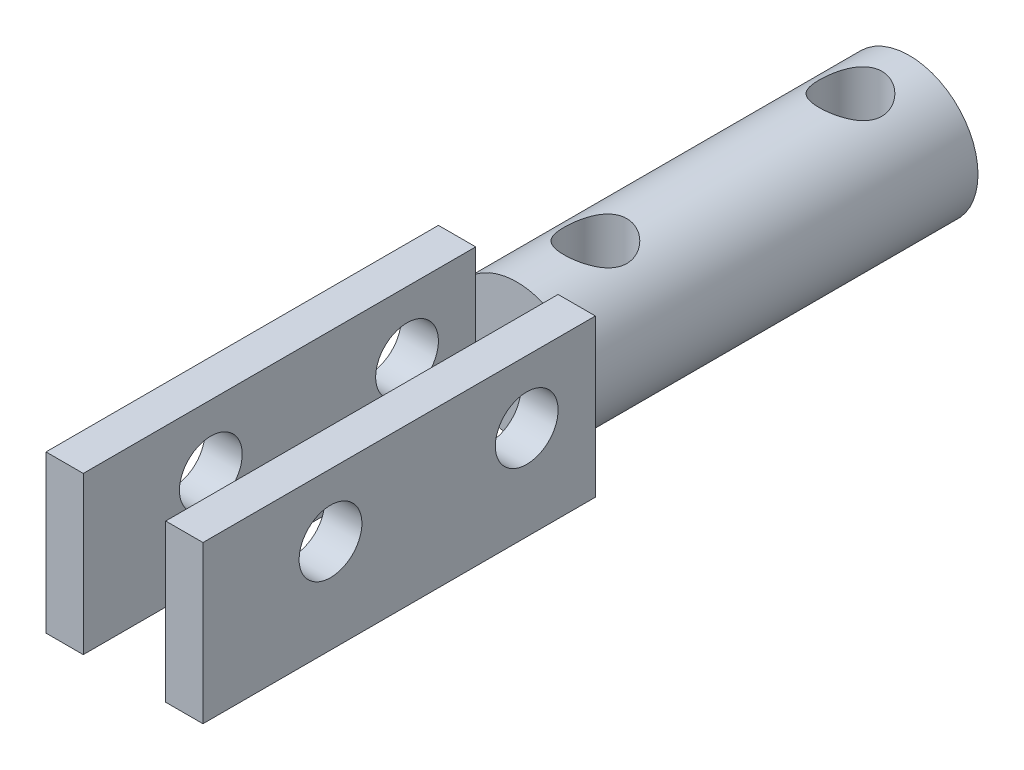
ISO-10303-21;
HEADER;
FILE_DESCRIPTION(('STEP AP214'),'2;1');
FILE_NAME('part.step','',(''),(''),'','','');
FILE_SCHEMA(('AUTOMOTIVE_DESIGN { 1 0 10303 214 1 1 1 1 }'));
ENDSEC;
DATA;
#1=APPLICATION_CONTEXT('core data for automotive mechanical design processes');
#2=APPLICATION_PROTOCOL_DEFINITION('international standard','automotive_design',2000,#1);
#3=PRODUCT_CONTEXT('',#1,'mechanical');
#4=PRODUCT('Part','Part','',(#3));
#5=PRODUCT_RELATED_PRODUCT_CATEGORY('part','',(#4));
#6=PRODUCT_DEFINITION_FORMATION('','',#4);
#7=PRODUCT_DEFINITION_CONTEXT('part definition',#1,'design');
#8=PRODUCT_DEFINITION('design','',#6,#7);
#9=PRODUCT_DEFINITION_SHAPE('','',#8);
#10=(LENGTH_UNIT() NAMED_UNIT(*) SI_UNIT(.MILLI.,.METRE.));
#11=(NAMED_UNIT(*) PLANE_ANGLE_UNIT() SI_UNIT($,.RADIAN.));
#12=(NAMED_UNIT(*) SI_UNIT($,.STERADIAN.) SOLID_ANGLE_UNIT());
#13=UNCERTAINTY_MEASURE_WITH_UNIT(LENGTH_MEASURE(1.E-05),#10,'distance_accuracy_value','');
#14=(GEOMETRIC_REPRESENTATION_CONTEXT(3) GLOBAL_UNCERTAINTY_ASSIGNED_CONTEXT((#13)) GLOBAL_UNIT_ASSIGNED_CONTEXT((#10,
#11,#12)) REPRESENTATION_CONTEXT('',''));
#15=CARTESIAN_POINT('',(0.,0.,0.));
#16=DIRECTION('',(0.,0.,1.));
#17=DIRECTION('',(1.,0.,0.));
#18=AXIS2_PLACEMENT_3D('',#15,#16,#17);
#19=CARTESIAN_POINT('',(-4.,-4.,40.));
#20=DIRECTION('',(0.,1.,0.));
#21=DIRECTION('',(0.,0.,1.));
#22=AXIS2_PLACEMENT_3D('',#19,#20,#21);
#23=PLANE('',#22);
#24=DIRECTION('',(1.,0.,0.));
#25=VECTOR('',#24,1.);
#26=CARTESIAN_POINT('',(-4.,-4.,40.));
#27=LINE('',#26,#25);
#28=CARTESIAN_POINT('',(2.1,-4.,40.));
#29=VERTEX_POINT('',#28);
#30=CARTESIAN_POINT('',(4.,-4.,40.));
#31=VERTEX_POINT('',#30);
#32=EDGE_CURVE('E155',#29,#31,#27,.T.);
#33=ORIENTED_EDGE('',*,*,#32,.F.);
#34=DIRECTION('',(0.,0.,1.));
#35=VECTOR('',#34,1.);
#36=CARTESIAN_POINT('',(2.1,-4.,20.));
#37=LINE('',#36,#35);
#38=CARTESIAN_POINT('',(2.1,-4.,20.));
#39=VERTEX_POINT('',#38);
#40=EDGE_CURVE('E236',#39,#29,#37,.T.);
#41=ORIENTED_EDGE('',*,*,#40,.F.);
#42=DIRECTION('',(1.,0.,0.));
#43=VECTOR('',#42,1.);
#44=CARTESIAN_POINT('',(-4.,-4.,20.));
#45=LINE('',#44,#43);
#46=CARTESIAN_POINT('',(4.,-4.,20.));
#47=VERTEX_POINT('',#46);
#48=EDGE_CURVE('E232',#39,#47,#45,.T.);
#49=ORIENTED_EDGE('',*,*,#48,.T.);
#50=DIRECTION('',(0.,0.,-1.));
#51=VECTOR('',#50,1.);
#52=CARTESIAN_POINT('',(4.,-4.,40.));
#53=LINE('',#52,#51);
#54=EDGE_CURVE('E165',#31,#47,#53,.T.);
#55=ORIENTED_EDGE('',*,*,#54,.F.);
#56=EDGE_LOOP('',(#33,#41,#49,#55));
#57=FACE_BOUND('',#56,.T.);
#58=ADVANCED_FACE('F35',(#57),#23,.F.);
#59=CARTESIAN_POINT('',(-4.,4.,40.));
#60=DIRECTION('',(0.,-1.,0.));
#61=DIRECTION('',(0.,0.,-1.));
#62=AXIS2_PLACEMENT_3D('',#59,#60,#61);
#63=PLANE('',#62);
#64=DIRECTION('',(-1.,0.,0.));
#65=VECTOR('',#64,1.);
#66=CARTESIAN_POINT('',(-4.,4.,20.));
#67=LINE('',#66,#65);
#68=CARTESIAN_POINT('',(4.,4.,20.));
#69=VERTEX_POINT('',#68);
#70=CARTESIAN_POINT('',(2.1,4.,20.));
#71=VERTEX_POINT('',#70);
#72=EDGE_CURVE('E144',#69,#71,#67,.T.);
#73=ORIENTED_EDGE('',*,*,#72,.T.);
#74=DIRECTION('',(0.,0.,1.));
#75=VECTOR('',#74,1.);
#76=CARTESIAN_POINT('',(2.1,4.,20.));
#77=LINE('',#76,#75);
#78=CARTESIAN_POINT('',(2.1,4.,40.));
#79=VERTEX_POINT('',#78);
#80=EDGE_CURVE('E125',#71,#79,#77,.T.);
#81=ORIENTED_EDGE('',*,*,#80,.T.);
#82=DIRECTION('',(-1.,0.,0.));
#83=VECTOR('',#82,1.);
#84=CARTESIAN_POINT('',(-4.,4.,40.));
#85=LINE('',#84,#83);
#86=CARTESIAN_POINT('',(4.,4.,40.));
#87=VERTEX_POINT('',#86);
#88=EDGE_CURVE('E163',#87,#79,#85,.T.);
#89=ORIENTED_EDGE('',*,*,#88,.F.);
#90=DIRECTION('',(0.,0.,-1.));
#91=VECTOR('',#90,1.);
#92=CARTESIAN_POINT('',(4.,4.,40.));
#93=LINE('',#92,#91);
#94=EDGE_CURVE('E152',#87,#69,#93,.T.);
#95=ORIENTED_EDGE('',*,*,#94,.T.);
#96=EDGE_LOOP('',(#73,#81,#89,#95));
#97=FACE_BOUND('',#96,.T.);
#98=ADVANCED_FACE('F150',(#97),#63,.F.);
#99=CARTESIAN_POINT('',(0.,0.,40.));
#100=DIRECTION('',(0.,0.,-1.));
#101=DIRECTION('',(-1.,0.,0.));
#102=AXIS2_PLACEMENT_3D('',#99,#100,#101);
#103=PLANE('',#102);
#104=ORIENTED_EDGE('',*,*,#88,.T.);
#105=DIRECTION('',(0.,1.,0.));
#106=VECTOR('',#105,1.);
#107=CARTESIAN_POINT('',(2.1,-4.,40.));
#108=LINE('',#107,#106);
#109=EDGE_CURVE('E131',#29,#79,#108,.T.);
#110=ORIENTED_EDGE('',*,*,#109,.F.);
#111=ORIENTED_EDGE('',*,*,#32,.T.);
#112=DIRECTION('',(0.,1.,0.));
#113=VECTOR('',#112,1.);
#114=CARTESIAN_POINT('',(4.,-4.,40.));
#115=LINE('',#114,#113);
#116=EDGE_CURVE('E238',#31,#87,#115,.T.);
#117=ORIENTED_EDGE('',*,*,#116,.T.);
#118=EDGE_LOOP('',(#104,#110,#111,#117));
#119=FACE_BOUND('',#118,.T.);
#120=ADVANCED_FACE('F210',(#119),#103,.F.);
#121=CARTESIAN_POINT('',(0.,0.,20.));
#122=DIRECTION('',(0.,0.,-1.));
#123=DIRECTION('',(-1.,0.,0.));
#124=AXIS2_PLACEMENT_3D('',#121,#122,#123);
#125=PLANE('',#124);
#126=DIRECTION('',(0.,-1.,0.));
#127=VECTOR('',#126,1.);
#128=CARTESIAN_POINT('',(2.1,0.,20.));
#129=LINE('',#128,#127);
#130=CARTESIAN_POINT('',(2.1,2.8,20.));
#131=VERTEX_POINT('',#130);
#132=EDGE_CURVE('E11',#71,#131,#129,.T.);
#133=ORIENTED_EDGE('',*,*,#132,.F.);
#134=ORIENTED_EDGE('',*,*,#72,.F.);
#135=DIRECTION('',(0.,1.,0.));
#136=VECTOR('',#135,1.);
#137=CARTESIAN_POINT('',(4.,-4.,20.));
#138=LINE('',#137,#136);
#139=EDGE_CURVE('E157',#47,#69,#138,.T.);
#140=ORIENTED_EDGE('',*,*,#139,.F.);
#141=ORIENTED_EDGE('',*,*,#48,.F.);
#142=DIRECTION('',(0.,1.,0.));
#143=VECTOR('',#142,1.);
#144=CARTESIAN_POINT('',(2.1,-4.,20.));
#145=LINE('',#144,#143);
#146=CARTESIAN_POINT('',(2.1,-2.8,20.));
#147=VERTEX_POINT('',#146);
#148=EDGE_CURVE('E251',#39,#147,#145,.T.);
#149=ORIENTED_EDGE('',*,*,#148,.T.);
#150=CARTESIAN_POINT('',(0.,0.,20.));
#151=DIRECTION('',(0.,0.,1.));
#152=DIRECTION('',(1.,0.,0.));
#153=AXIS2_PLACEMENT_3D('',#150,#151,#152);
#154=CIRCLE('',#153,3.5);
#155=EDGE_CURVE('E147',#147,#131,#154,.T.);
#156=ORIENTED_EDGE('',*,*,#155,.T.);
#157=EDGE_LOOP('',(#133,#134,#140,#141,#149,#156));
#158=FACE_BOUND('',#157,.T.);
#159=ADVANCED_FACE('F142',(#158),#125,.T.);
#160=CARTESIAN_POINT('',(0.,0.,20.));
#161=DIRECTION('',(0.,0.,-1.));
#162=DIRECTION('',(-1.,0.,0.));
#163=AXIS2_PLACEMENT_3D('',#160,#161,#162);
#164=CYLINDRICAL_SURFACE('',#163,3.5);
#165=CARTESIAN_POINT('',(0.,-3.5,17.6));
#166=CARTESIAN_POINT('',(0.0849546920938216,-3.49999636857147,17.5999956294693));
#167=CARTESIAN_POINT('',(0.170035367234034,-3.49687258666383,17.5931939178778));
#168=CARTESIAN_POINT('',(0.337734619080855,-3.48468667919458,17.5662632753988));
#169=CARTESIAN_POINT('',(0.420347080881438,-3.47561090780939,17.5461037185559));
#170=CARTESIAN_POINT('',(0.580419958882175,-3.45248157243343,17.493380684901));
#171=CARTESIAN_POINT('',(0.657897963364502,-3.43844616965025,17.4608624308582));
#172=CARTESIAN_POINT('',(0.806207901759922,-3.40672687511541,17.384553885457));
#173=CARTESIAN_POINT('',(0.877041117866257,-3.38904368936353,17.3407657748854));
#174=CARTESIAN_POINT('',(1.01428303261885,-3.35060812744589,17.2404959785904));
#175=CARTESIAN_POINT('',(1.08025782843876,-3.32974271294585,17.183464242197));
#176=CARTESIAN_POINT('',(1.20209294739424,-3.28772469886357,17.0594969575991));
#177=CARTESIAN_POINT('',(1.25794688859137,-3.26657192705493,16.9925552084072));
#178=CARTESIAN_POINT('',(1.36139889339868,-3.22488702478548,16.8456657523391));
#179=CARTESIAN_POINT('',(1.40827128561616,-3.2044744940371,16.7651692780207));
#180=CARTESIAN_POINT('',(1.48761940675725,-3.16842257713251,16.5963802487047));
#181=CARTESIAN_POINT('',(1.52010399189535,-3.15278025659208,16.508092529752));
#182=CARTESIAN_POINT('',(1.56787504677552,-3.12928840533856,16.3312001776208));
#183=CARTESIAN_POINT('',(1.58400231901965,-3.12106063250246,16.242875047444));
#184=CARTESIAN_POINT('',(1.60120883377355,-3.11227153390165,16.0644194875399));
#185=CARTESIAN_POINT('',(1.60229905265264,-3.11170461606518,15.974290422737));
#186=CARTESIAN_POINT('',(1.59002495837755,-3.11798806083653,15.8040368781251));
#187=CARTESIAN_POINT('',(1.57803606499003,-3.12413270144171,15.7237814787666));
#188=CARTESIAN_POINT('',(1.54228654272029,-3.14193359565331,15.5665800040166));
#189=CARTESIAN_POINT('',(1.51852305983586,-3.15359118549327,15.4896347358731));
#190=CARTESIAN_POINT('',(1.45942983247509,-3.18137501550487,15.3391265580986));
#191=CARTESIAN_POINT('',(1.42384834377428,-3.19759722604373,15.2656810197836));
#192=CARTESIAN_POINT('',(1.34231214956677,-3.23267151815208,15.1254820927943));
#193=CARTESIAN_POINT('',(1.29635297502042,-3.25152473139478,15.0587316052104));
#194=CARTESIAN_POINT('',(1.18978870650401,-3.29210804395797,14.9265304047983));
#195=CARTESIAN_POINT('',(1.12815906866868,-3.31393373622149,14.8619322711553));
#196=CARTESIAN_POINT('',(0.99477657074101,-3.35638441746891,14.7436692089175));
#197=CARTESIAN_POINT('',(0.923020306065264,-3.37700899933025,14.6900079722111));
#198=CARTESIAN_POINT('',(0.768377308835002,-3.41557372899641,14.5935269751696));
#199=CARTESIAN_POINT('',(0.685202005932096,-3.43340320461254,14.5511220897446));
#200=CARTESIAN_POINT('',(0.51187382340113,-3.46348083741206,14.4812173033237));
#201=CARTESIAN_POINT('',(0.421725644708009,-3.47573271715452,14.4537074588575));
#202=CARTESIAN_POINT('',(0.244073336677428,-3.49253512458966,14.4163151232408));
#203=CARTESIAN_POINT('',(0.156856291500207,-3.49758239208216,14.4052928234557));
#204=CARTESIAN_POINT('',(-0.0183227390656962,-3.50104664955387,14.3977072609793));
#205=CARTESIAN_POINT('',(-0.10628443956759,-3.49946607008894,14.4011386978334));
#206=CARTESIAN_POINT('',(-0.274663189385483,-3.49016242167809,14.4216128769259));
#207=CARTESIAN_POINT('',(-0.355209045099311,-3.48282783089316,14.4377950552513));
#208=CARTESIAN_POINT('',(-0.512319894670045,-3.46320654420996,14.4820436601151));
#209=CARTESIAN_POINT('',(-0.58888441354369,-3.45091925896643,14.5101115010065));
#210=CARTESIAN_POINT('',(-0.738560945796367,-3.42206368162539,14.5782059478591));
#211=CARTESIAN_POINT('',(-0.81149269797102,-3.40537463453565,14.6185758722096));
#212=CARTESIAN_POINT('',(-0.949807908803028,-3.36941836450709,14.709754204604));
#213=CARTESIAN_POINT('',(-1.01518803425385,-3.35015001113001,14.7605671948104));
#214=CARTESIAN_POINT('',(-1.1423931790364,-3.30904459791473,14.8761952053057));
#215=CARTESIAN_POINT('',(-1.20344747481963,-3.28712822832994,14.9418318681042));
#216=CARTESIAN_POINT('',(-1.3139542023285,-3.24453992098043,15.0826457203143));
#217=CARTESIAN_POINT('',(-1.36340173141796,-3.2238685118112,15.1578269207019));
#218=CARTESIAN_POINT('',(-1.45052800964305,-3.18564017646646,15.3184258527823));
#219=CARTESIAN_POINT('',(-1.4878322744373,-3.168188482782,15.4040738146115));
#220=CARTESIAN_POINT('',(-1.54711944010027,-3.13966916060864,15.5814962310273));
#221=CARTESIAN_POINT('',(-1.56911845359106,-3.12859482047607,15.6732641309305));
#222=CARTESIAN_POINT('',(-1.59542743313284,-3.1152542503065,15.8516384603198));
#223=CARTESIAN_POINT('',(-1.60112300122462,-3.11229900074027,15.9379889842191));
#224=CARTESIAN_POINT('',(-1.59851097403519,-3.11364208661797,16.1104096422516));
#225=CARTESIAN_POINT('',(-1.59020686891108,-3.11793861417419,16.1964798409112));
#226=CARTESIAN_POINT('',(-1.5610649948802,-3.13262046621161,16.3598631184898));
#227=CARTESIAN_POINT('',(-1.54110743374518,-3.14257700350806,16.437375904772));
#228=CARTESIAN_POINT('',(-1.49018785344423,-3.16703858544215,16.5879283838421));
#229=CARTESIAN_POINT('',(-1.45922260245556,-3.18154496575185,16.6609667555652));
#230=CARTESIAN_POINT('',(-1.38485723540081,-3.21464263004063,16.8057427311305));
#231=CARTESIAN_POINT('',(-1.3407759788003,-3.23343911026522,16.8770824228401));
#232=CARTESIAN_POINT('',(-1.24228367259492,-3.27254297053248,17.0117804209045));
#233=CARTESIAN_POINT('',(-1.18786800701897,-3.2928510232605,17.0751351395704));
#234=CARTESIAN_POINT('',(-1.06417025047517,-3.33499609408312,17.1982731788451));
#235=CARTESIAN_POINT('',(-0.993968269528871,-3.35679575834795,17.2571499667011));
#236=CARTESIAN_POINT('',(-0.843943932634142,-3.39761603962391,17.3624070059809));
#237=CARTESIAN_POINT('',(-0.764117123470956,-3.41663536115275,17.4087814404579));
#238=CARTESIAN_POINT('',(-0.597501068875906,-3.44965886381635,17.4870770559308));
#239=CARTESIAN_POINT('',(-0.510773520624735,-3.46370245622265,17.5191123718809));
#240=CARTESIAN_POINT('',(-0.332483127753006,-3.48532039137283,17.5677822601591));
#241=CARTESIAN_POINT('',(-0.240935720609917,-3.49291419544956,17.5844631750903));
#242=CARTESIAN_POINT('',(-0.123947776649979,-3.49789321521678,17.595386192649));
#243=CARTESIAN_POINT('',(-0.0991996794234601,-3.49868178096364,17.5971146115848));
#244=CARTESIAN_POINT('',(-0.0496379745304106,-3.4997357082092,17.5994221632324));
#245=CARTESIAN_POINT('',(-0.0248243657964269,-3.50000106112927,17.6000012771002));
#246=CARTESIAN_POINT('',(0.,-3.5,17.6));
#247=B_SPLINE_CURVE_WITH_KNOTS('',3,(#165,#166,#167,#168,#169,#170,#171,#172,#173,#174,#175,
#176,#177,#178,#179,#180,#181,#182,#183,#184,#185,#186,#187,#188,#189,#190,#191,#192,#193,#194,
#195,#196,#197,#198,#199,#200,#201,#202,#203,#204,#205,#206,#207,#208,#209,#210,#211,#212,#213,
#214,#215,#216,#217,#218,#219,#220,#221,#222,#223,#224,#225,#226,#227,#228,#229,#230,#231,#232,
#233,#234,#235,#236,#237,#238,#239,#240,#241,#242,#243,#244,#245,#246),.UNSPECIFIED.,.T.,.F.,(4,
2,2,2,2,2,2,2,2,2,2,2,2,2,2,2,2,2,2,2,2,2,2,2,2,2,2,2,2,2,2,2,2,2,2,2,2,2,2,2,4),(0.,
0.254762372543852,0.510110877359209,0.764533873042898,1.01890767327341,1.28677251104713,
1.55480567380393,1.83944107802633,2.12390103456667,2.39285807860623,2.661618785761,
2.90461936484523,3.14767887283766,3.39628910399907,3.6450066013791,3.91951574999508,
4.19411740973848,4.47775550606701,4.76120402015727,5.0239688764781,5.28663738042343,
5.53295546003439,5.77930285889179,6.03327665874152,6.28736213492594,6.56297842949938,
6.83871093426433,7.12228121350259,7.40555251020383,7.66390974496946,7.92220258008885,
8.16312970564549,8.40412762514055,8.66089668874696,8.91778071181037,9.19899413530982,
9.48033817353766,9.75940114382056,10.0376190586467,10.1120612169299,10.186504595763),.UNSPECIFIED.);
#248=CARTESIAN_POINT('',(0.,-3.5,17.6));
#249=VERTEX_POINT('',#248);
#250=EDGE_CURVE('E421',#249,#249,#247,.T.);
#251=ORIENTED_EDGE('',*,*,#250,.T.);
#252=EDGE_LOOP('',(#251));
#253=FACE_BOUND('',#252,.T.);
#254=CARTESIAN_POINT('',(0.,3.5,17.6));
#255=CARTESIAN_POINT('',(-0.0849546920938216,3.49999636857147,17.5999956294693));
#256=CARTESIAN_POINT('',(-0.170035367234034,3.49687258666383,17.5931939178778));
#257=CARTESIAN_POINT('',(-0.337734619080855,3.48468667919458,17.5662632753988));
#258=CARTESIAN_POINT('',(-0.420347080881438,3.47561090780939,17.5461037185559));
#259=CARTESIAN_POINT('',(-0.580419958882175,3.45248157243343,17.493380684901));
#260=CARTESIAN_POINT('',(-0.657897963364502,3.43844616965025,17.4608624308582));
#261=CARTESIAN_POINT('',(-0.806207901759922,3.40672687511541,17.384553885457));
#262=CARTESIAN_POINT('',(-0.877041117866257,3.38904368936353,17.3407657748854));
#263=CARTESIAN_POINT('',(-1.01428303261885,3.35060812744589,17.2404959785904));
#264=CARTESIAN_POINT('',(-1.08025782843876,3.32974271294585,17.183464242197));
#265=CARTESIAN_POINT('',(-1.20209294739424,3.28772469886357,17.0594969575991));
#266=CARTESIAN_POINT('',(-1.25794688859137,3.26657192705493,16.9925552084072));
#267=CARTESIAN_POINT('',(-1.36139889339868,3.22488702478548,16.8456657523391));
#268=CARTESIAN_POINT('',(-1.40827128561616,3.2044744940371,16.7651692780207));
#269=CARTESIAN_POINT('',(-1.48761940675725,3.16842257713251,16.5963802487047));
#270=CARTESIAN_POINT('',(-1.52010399189535,3.15278025659208,16.508092529752));
#271=CARTESIAN_POINT('',(-1.56787504677552,3.12928840533856,16.3312001776208));
#272=CARTESIAN_POINT('',(-1.58400231901965,3.12106063250246,16.242875047444));
#273=CARTESIAN_POINT('',(-1.60120883377355,3.11227153390165,16.0644194875399));
#274=CARTESIAN_POINT('',(-1.60229905265264,3.11170461606518,15.974290422737));
#275=CARTESIAN_POINT('',(-1.59002495837755,3.11798806083653,15.8040368781251));
#276=CARTESIAN_POINT('',(-1.57803606499003,3.12413270144171,15.7237814787666));
#277=CARTESIAN_POINT('',(-1.54228654272029,3.14193359565331,15.5665800040166));
#278=CARTESIAN_POINT('',(-1.51852305983586,3.15359118549327,15.4896347358731));
#279=CARTESIAN_POINT('',(-1.45942983247509,3.18137501550487,15.3391265580986));
#280=CARTESIAN_POINT('',(-1.42384834377428,3.19759722604373,15.2656810197836));
#281=CARTESIAN_POINT('',(-1.34231214956677,3.23267151815208,15.1254820927943));
#282=CARTESIAN_POINT('',(-1.29635297502042,3.25152473139478,15.0587316052104));
#283=CARTESIAN_POINT('',(-1.18978870650401,3.29210804395797,14.9265304047983));
#284=CARTESIAN_POINT('',(-1.12815906866868,3.31393373622149,14.8619322711553));
#285=CARTESIAN_POINT('',(-0.99477657074101,3.35638441746891,14.7436692089175));
#286=CARTESIAN_POINT('',(-0.923020306065264,3.37700899933025,14.6900079722111));
#287=CARTESIAN_POINT('',(-0.768377308835002,3.41557372899641,14.5935269751696));
#288=CARTESIAN_POINT('',(-0.685202005932096,3.43340320461254,14.5511220897446));
#289=CARTESIAN_POINT('',(-0.51187382340113,3.46348083741206,14.4812173033237));
#290=CARTESIAN_POINT('',(-0.421725644708009,3.47573271715452,14.4537074588575));
#291=CARTESIAN_POINT('',(-0.244073336677428,3.49253512458966,14.4163151232408));
#292=CARTESIAN_POINT('',(-0.156856291500207,3.49758239208216,14.4052928234557));
#293=CARTESIAN_POINT('',(0.0183227390656962,3.50104664955387,14.3977072609793));
#294=CARTESIAN_POINT('',(0.10628443956759,3.49946607008894,14.4011386978334));
#295=CARTESIAN_POINT('',(0.274663189385483,3.49016242167809,14.4216128769259));
#296=CARTESIAN_POINT('',(0.355209045099311,3.48282783089316,14.4377950552513));
#297=CARTESIAN_POINT('',(0.512319894670045,3.46320654420996,14.4820436601151));
#298=CARTESIAN_POINT('',(0.58888441354369,3.45091925896643,14.5101115010065));
#299=CARTESIAN_POINT('',(0.738560945796367,3.42206368162539,14.5782059478591));
#300=CARTESIAN_POINT('',(0.81149269797102,3.40537463453565,14.6185758722096));
#301=CARTESIAN_POINT('',(0.949807908803028,3.36941836450709,14.709754204604));
#302=CARTESIAN_POINT('',(1.01518803425385,3.35015001113001,14.7605671948104));
#303=CARTESIAN_POINT('',(1.1423931790364,3.30904459791473,14.8761952053057));
#304=CARTESIAN_POINT('',(1.20344747481963,3.28712822832994,14.9418318681042));
#305=CARTESIAN_POINT('',(1.3139542023285,3.24453992098043,15.0826457203143));
#306=CARTESIAN_POINT('',(1.36340173141796,3.2238685118112,15.1578269207019));
#307=CARTESIAN_POINT('',(1.45052800964305,3.18564017646646,15.3184258527823));
#308=CARTESIAN_POINT('',(1.4878322744373,3.168188482782,15.4040738146115));
#309=CARTESIAN_POINT('',(1.54711944010027,3.13966916060864,15.5814962310273));
#310=CARTESIAN_POINT('',(1.56911845359106,3.12859482047607,15.6732641309305));
#311=CARTESIAN_POINT('',(1.59542743313284,3.1152542503065,15.8516384603198));
#312=CARTESIAN_POINT('',(1.60112300122462,3.11229900074027,15.9379889842191));
#313=CARTESIAN_POINT('',(1.59851097403519,3.11364208661797,16.1104096422516));
#314=CARTESIAN_POINT('',(1.59020686891108,3.11793861417419,16.1964798409112));
#315=CARTESIAN_POINT('',(1.5610649948802,3.13262046621161,16.3598631184898));
#316=CARTESIAN_POINT('',(1.54110743374518,3.14257700350806,16.437375904772));
#317=CARTESIAN_POINT('',(1.49018785344423,3.16703858544215,16.5879283838421));
#318=CARTESIAN_POINT('',(1.45922260245556,3.18154496575185,16.6609667555652));
#319=CARTESIAN_POINT('',(1.38485723540081,3.21464263004063,16.8057427311305));
#320=CARTESIAN_POINT('',(1.3407759788003,3.23343911026522,16.8770824228401));
#321=CARTESIAN_POINT('',(1.24228367259492,3.27254297053248,17.0117804209045));
#322=CARTESIAN_POINT('',(1.18786800701897,3.2928510232605,17.0751351395704));
#323=CARTESIAN_POINT('',(1.06417025047517,3.33499609408312,17.1982731788451));
#324=CARTESIAN_POINT('',(0.993968269528871,3.35679575834795,17.2571499667011));
#325=CARTESIAN_POINT('',(0.843943932634142,3.39761603962391,17.3624070059809));
#326=CARTESIAN_POINT('',(0.764117123470956,3.41663536115275,17.4087814404579));
#327=CARTESIAN_POINT('',(0.597501068875906,3.44965886381635,17.4870770559308));
#328=CARTESIAN_POINT('',(0.510773520624735,3.46370245622265,17.5191123718809));
#329=CARTESIAN_POINT('',(0.332483127753006,3.48532039137283,17.5677822601591));
#330=CARTESIAN_POINT('',(0.240935720609917,3.49291419544956,17.5844631750903));
#331=CARTESIAN_POINT('',(0.123947776649979,3.49789321521678,17.595386192649));
#332=CARTESIAN_POINT('',(0.0991996794234601,3.49868178096364,17.5971146115848));
#333=CARTESIAN_POINT('',(0.0496379745304106,3.4997357082092,17.5994221632324));
#334=CARTESIAN_POINT('',(0.0248243657964269,3.50000106112927,17.6000012771002));
#335=CARTESIAN_POINT('',(0.,3.5,17.6));
#336=B_SPLINE_CURVE_WITH_KNOTS('',3,(#254,#255,#256,#257,#258,#259,#260,#261,#262,#263,#264,
#265,#266,#267,#268,#269,#270,#271,#272,#273,#274,#275,#276,#277,#278,#279,#280,#281,#282,#283,
#284,#285,#286,#287,#288,#289,#290,#291,#292,#293,#294,#295,#296,#297,#298,#299,#300,#301,#302,
#303,#304,#305,#306,#307,#308,#309,#310,#311,#312,#313,#314,#315,#316,#317,#318,#319,#320,#321,
#322,#323,#324,#325,#326,#327,#328,#329,#330,#331,#332,#333,#334,#335),.UNSPECIFIED.,.T.,.F.,(4,
2,2,2,2,2,2,2,2,2,2,2,2,2,2,2,2,2,2,2,2,2,2,2,2,2,2,2,2,2,2,2,2,2,2,2,2,2,2,2,4),(0.,
0.254762372543852,0.510110877359209,0.764533873042898,1.01890767327341,1.28677251104713,
1.55480567380393,1.83944107802633,2.12390103456667,2.39285807860623,2.661618785761,
2.90461936484523,3.14767887283766,3.39628910399907,3.6450066013791,3.91951574999508,
4.19411740973848,4.47775550606701,4.76120402015727,5.0239688764781,5.28663738042343,
5.53295546003439,5.77930285889179,6.03327665874152,6.28736213492594,6.56297842949938,
6.83871093426433,7.12228121350259,7.40555251020383,7.66390974496946,7.92220258008885,
8.16312970564549,8.40412762514055,8.66089668874696,8.91778071181037,9.19899413530982,
9.48033817353766,9.75940114382056,10.0376190586467,10.1120612169299,10.186504595763),.UNSPECIFIED.);
#337=CARTESIAN_POINT('',(0.,3.5,17.6));
#338=VERTEX_POINT('',#337);
#339=EDGE_CURVE('E425',#338,#338,#336,.T.);
#340=ORIENTED_EDGE('',*,*,#339,.T.);
#341=EDGE_LOOP('',(#340));
#342=FACE_BOUND('',#341,.T.);
#343=CARTESIAN_POINT('',(0.,-3.5,4.6));
#344=CARTESIAN_POINT('',(0.0849546920938215,-3.49999636857147,4.59999562946931));
#345=CARTESIAN_POINT('',(0.170035367234034,-3.49687258666383,4.59319391787777));
#346=CARTESIAN_POINT('',(0.337734619080855,-3.48468667919458,4.56626327539884));
#347=CARTESIAN_POINT('',(0.420347080881437,-3.47561090780939,4.54610371855588));
#348=CARTESIAN_POINT('',(0.580419958882175,-3.45248157243343,4.493380684901));
#349=CARTESIAN_POINT('',(0.657897963364502,-3.43844616965025,4.46086243085822));
#350=CARTESIAN_POINT('',(0.806207901759922,-3.40672687511541,4.38455388545702));
#351=CARTESIAN_POINT('',(0.877041117866256,-3.38904368936353,4.3407657748854));
#352=CARTESIAN_POINT('',(1.01428303261885,-3.35060812744589,4.24049597859038));
#353=CARTESIAN_POINT('',(1.08025782843876,-3.32974271294585,4.18346424219701));
#354=CARTESIAN_POINT('',(1.20209294739424,-3.28772469886357,4.05949695759906));
#355=CARTESIAN_POINT('',(1.25794688859137,-3.26657192705493,3.99255520840724));
#356=CARTESIAN_POINT('',(1.36139889339868,-3.22488702478548,3.84566575233909));
#357=CARTESIAN_POINT('',(1.40827128561616,-3.2044744940371,3.76516927802068));
#358=CARTESIAN_POINT('',(1.48761940675725,-3.16842257713251,3.5963802487047));
#359=CARTESIAN_POINT('',(1.52010399189535,-3.15278025659208,3.50809252975195));
#360=CARTESIAN_POINT('',(1.56787504677552,-3.12928840533856,3.33120017762081));
#361=CARTESIAN_POINT('',(1.58400231901965,-3.12106063250246,3.24287504744401));
#362=CARTESIAN_POINT('',(1.60120883377355,-3.11227153390165,3.06441948753985));
#363=CARTESIAN_POINT('',(1.60229905265264,-3.11170461606518,2.97429042273698));
#364=CARTESIAN_POINT('',(1.59002495837755,-3.11798806083653,2.80403687812515));
#365=CARTESIAN_POINT('',(1.57803606499002,-3.12413270144171,2.72378147876661));
#366=CARTESIAN_POINT('',(1.54228654272029,-3.14193359565331,2.56658000401657));
#367=CARTESIAN_POINT('',(1.51852305983586,-3.15359118549327,2.48963473587312));
#368=CARTESIAN_POINT('',(1.45942983247509,-3.18137501550487,2.33912655809862));
#369=CARTESIAN_POINT('',(1.42384834377428,-3.19759722604373,2.26568101978364));
#370=CARTESIAN_POINT('',(1.34231214956676,-3.23267151815209,2.12548209279433));
#371=CARTESIAN_POINT('',(1.29635297502042,-3.25152473139478,2.05873160521038));
#372=CARTESIAN_POINT('',(1.18978870650401,-3.29210804395797,1.92653040479833));
#373=CARTESIAN_POINT('',(1.12815906866868,-3.31393373622149,1.86193227115526));
#374=CARTESIAN_POINT('',(0.99477657074101,-3.35638441746891,1.74366920891753));
#375=CARTESIAN_POINT('',(0.923020306065264,-3.37700899933025,1.69000797221107));
#376=CARTESIAN_POINT('',(0.768377308835003,-3.41557372899641,1.5935269751696));
#377=CARTESIAN_POINT('',(0.685202005932097,-3.43340320461254,1.55112208974465));
#378=CARTESIAN_POINT('',(0.51187382340113,-3.46348083741206,1.48121730332369));
#379=CARTESIAN_POINT('',(0.421725644708009,-3.47573271715452,1.45370745885754));
#380=CARTESIAN_POINT('',(0.244073336677428,-3.49253512458966,1.41631512324078));
#381=CARTESIAN_POINT('',(0.156856291500207,-3.49758239208216,1.40529282345575));
#382=CARTESIAN_POINT('',(-0.0183227390656966,-3.50104664955387,1.39770726097928));
#383=CARTESIAN_POINT('',(-0.10628443956759,-3.49946607008894,1.40113869783343));
#384=CARTESIAN_POINT('',(-0.274663189385482,-3.49016242167809,1.42161287692592));
#385=CARTESIAN_POINT('',(-0.35520904509931,-3.48282783089316,1.43779505525131));
#386=CARTESIAN_POINT('',(-0.512319894670043,-3.46320654420996,1.48204366011509));
#387=CARTESIAN_POINT('',(-0.588884413543689,-3.45091925896643,1.51011150100653));
#388=CARTESIAN_POINT('',(-0.738560945796366,-3.42206368162539,1.57820594785909));
#389=CARTESIAN_POINT('',(-0.811492697971019,-3.40537463453565,1.61857587220956));
#390=CARTESIAN_POINT('',(-0.949807908803027,-3.36941836450709,1.709754204604));
#391=CARTESIAN_POINT('',(-1.01518803425385,-3.35015001113001,1.76056719481038));
#392=CARTESIAN_POINT('',(-1.1423931790364,-3.30904459791473,1.87619520530575));
#393=CARTESIAN_POINT('',(-1.20344747481963,-3.28712822832994,1.9418318681042));
#394=CARTESIAN_POINT('',(-1.3139542023285,-3.24453992098043,2.08264572031429));
#395=CARTESIAN_POINT('',(-1.36340173141796,-3.2238685118112,2.15782692070186));
#396=CARTESIAN_POINT('',(-1.45052800964305,-3.18564017646646,2.31842585278233));
#397=CARTESIAN_POINT('',(-1.4878322744373,-3.168188482782,2.40407381461153));
#398=CARTESIAN_POINT('',(-1.54711944010026,-3.13966916060864,2.58149623102728));
#399=CARTESIAN_POINT('',(-1.56911845359106,-3.12859482047608,2.67326413093054));
#400=CARTESIAN_POINT('',(-1.59542743313284,-3.1152542503065,2.85163846031984));
#401=CARTESIAN_POINT('',(-1.60112300122462,-3.11229900074027,2.93798898421915));
#402=CARTESIAN_POINT('',(-1.59851097403518,-3.11364208661797,3.11040964225164));
#403=CARTESIAN_POINT('',(-1.59020686891108,-3.11793861417419,3.19647984091118));
#404=CARTESIAN_POINT('',(-1.5610649948802,-3.13262046621161,3.35986311848976));
#405=CARTESIAN_POINT('',(-1.54110743374518,-3.14257700350806,3.43737590477203));
#406=CARTESIAN_POINT('',(-1.49018785344423,-3.16703858544215,3.58792838384211));
#407=CARTESIAN_POINT('',(-1.45922260245556,-3.18154496575186,3.66096675556517));
#408=CARTESIAN_POINT('',(-1.38485723540081,-3.21464263004063,3.80574273113046));
#409=CARTESIAN_POINT('',(-1.3407759788003,-3.23343911026522,3.87708242284012));
#410=CARTESIAN_POINT('',(-1.24228367259492,-3.27254297053248,4.01178042090452));
#411=CARTESIAN_POINT('',(-1.18786800701897,-3.2928510232605,4.07513513957037));
#412=CARTESIAN_POINT('',(-1.06417025047517,-3.33499609408312,4.19827317884513));
#413=CARTESIAN_POINT('',(-0.993968269528871,-3.35679575834795,4.25714996670111));
#414=CARTESIAN_POINT('',(-0.843943932634143,-3.39761603962391,4.36240700598094));
#415=CARTESIAN_POINT('',(-0.764117123470956,-3.41663536115274,4.40878144045788));
#416=CARTESIAN_POINT('',(-0.597501068875905,-3.44965886381635,4.48707705593082));
#417=CARTESIAN_POINT('',(-0.510773520624733,-3.46370245622265,4.51911237188089));
#418=CARTESIAN_POINT('',(-0.332483127753005,-3.48532039137283,4.5677822601591));
#419=CARTESIAN_POINT('',(-0.240935720609916,-3.49291419544956,4.58446317509028));
#420=CARTESIAN_POINT('',(-0.123947776649978,-3.49789321521678,4.59538619264902));
#421=CARTESIAN_POINT('',(-0.0991996794234593,-3.49868178096364,4.59711461158478));
#422=CARTESIAN_POINT('',(-0.04963797453041,-3.4997357082092,4.59942216323241));
#423=CARTESIAN_POINT('',(-0.0248243657964266,-3.50000106112927,4.60000127710018));
#424=CARTESIAN_POINT('',(0.,-3.5,4.6));
#425=B_SPLINE_CURVE_WITH_KNOTS('',3,(#343,#344,#345,#346,#347,#348,#349,#350,#351,#352,#353,
#354,#355,#356,#357,#358,#359,#360,#361,#362,#363,#364,#365,#366,#367,#368,#369,#370,#371,#372,
#373,#374,#375,#376,#377,#378,#379,#380,#381,#382,#383,#384,#385,#386,#387,#388,#389,#390,#391,
#392,#393,#394,#395,#396,#397,#398,#399,#400,#401,#402,#403,#404,#405,#406,#407,#408,#409,#410,
#411,#412,#413,#414,#415,#416,#417,#418,#419,#420,#421,#422,#423,#424),.UNSPECIFIED.,.T.,.F.,(4,
2,2,2,2,2,2,2,2,2,2,2,2,2,2,2,2,2,2,2,2,2,2,2,2,2,2,2,2,2,2,2,2,2,2,2,2,2,2,2,4),(0.,
0.254762372543852,0.510110877359208,0.764533873042897,1.01890767327341,1.28677251104713,
1.55480567380393,1.83944107802633,2.12390103456667,2.39285807860623,2.661618785761,
2.90461936484523,3.14767887283766,3.39628910399907,3.64500660137909,3.91951574999508,
4.19411740973848,4.47775550606701,4.76120402015727,5.0239688764781,5.28663738042342,
5.53295546003438,5.77930285889179,6.03327665874152,6.28736213492594,6.56297842949938,
6.83871093426432,7.12228121350258,7.40555251020383,7.66390974496945,7.92220258008884,
8.16312970564548,8.40412762514054,8.66089668874695,8.91778071181036,9.19899413530981,
9.48033817353766,9.75940114382055,10.0376190586467,10.1120612169299,10.186504595763),.UNSPECIFIED.);
#426=CARTESIAN_POINT('',(0.,-3.5,4.6));
#427=VERTEX_POINT('',#426);
#428=EDGE_CURVE('E182',#427,#427,#425,.T.);
#429=ORIENTED_EDGE('',*,*,#428,.T.);
#430=EDGE_LOOP('',(#429));
#431=FACE_BOUND('',#430,.T.);
#432=CARTESIAN_POINT('',(0.,3.5,4.6));
#433=CARTESIAN_POINT('',(-0.0849546920938215,3.49999636857147,4.59999562946931));
#434=CARTESIAN_POINT('',(-0.170035367234034,3.49687258666383,4.59319391787777));
#435=CARTESIAN_POINT('',(-0.337734619080855,3.48468667919458,4.56626327539884));
#436=CARTESIAN_POINT('',(-0.420347080881437,3.47561090780939,4.54610371855588));
#437=CARTESIAN_POINT('',(-0.580419958882175,3.45248157243343,4.493380684901));
#438=CARTESIAN_POINT('',(-0.657897963364502,3.43844616965025,4.46086243085822));
#439=CARTESIAN_POINT('',(-0.806207901759922,3.40672687511541,4.38455388545702));
#440=CARTESIAN_POINT('',(-0.877041117866256,3.38904368936353,4.3407657748854));
#441=CARTESIAN_POINT('',(-1.01428303261885,3.35060812744589,4.24049597859038));
#442=CARTESIAN_POINT('',(-1.08025782843876,3.32974271294585,4.18346424219701));
#443=CARTESIAN_POINT('',(-1.20209294739424,3.28772469886357,4.05949695759906));
#444=CARTESIAN_POINT('',(-1.25794688859137,3.26657192705493,3.99255520840724));
#445=CARTESIAN_POINT('',(-1.36139889339868,3.22488702478548,3.84566575233909));
#446=CARTESIAN_POINT('',(-1.40827128561616,3.2044744940371,3.76516927802068));
#447=CARTESIAN_POINT('',(-1.48761940675725,3.16842257713251,3.5963802487047));
#448=CARTESIAN_POINT('',(-1.52010399189535,3.15278025659208,3.50809252975195));
#449=CARTESIAN_POINT('',(-1.56787504677552,3.12928840533856,3.33120017762081));
#450=CARTESIAN_POINT('',(-1.58400231901965,3.12106063250246,3.24287504744401));
#451=CARTESIAN_POINT('',(-1.60120883377355,3.11227153390165,3.06441948753985));
#452=CARTESIAN_POINT('',(-1.60229905265264,3.11170461606518,2.97429042273698));
#453=CARTESIAN_POINT('',(-1.59002495837755,3.11798806083653,2.80403687812515));
#454=CARTESIAN_POINT('',(-1.57803606499002,3.12413270144171,2.72378147876661));
#455=CARTESIAN_POINT('',(-1.54228654272029,3.14193359565331,2.56658000401657));
#456=CARTESIAN_POINT('',(-1.51852305983586,3.15359118549327,2.48963473587312));
#457=CARTESIAN_POINT('',(-1.45942983247509,3.18137501550487,2.33912655809862));
#458=CARTESIAN_POINT('',(-1.42384834377428,3.19759722604373,2.26568101978364));
#459=CARTESIAN_POINT('',(-1.34231214956676,3.23267151815209,2.12548209279433));
#460=CARTESIAN_POINT('',(-1.29635297502042,3.25152473139478,2.05873160521038));
#461=CARTESIAN_POINT('',(-1.18978870650401,3.29210804395797,1.92653040479833));
#462=CARTESIAN_POINT('',(-1.12815906866868,3.31393373622149,1.86193227115526));
#463=CARTESIAN_POINT('',(-0.99477657074101,3.35638441746891,1.74366920891753));
#464=CARTESIAN_POINT('',(-0.923020306065264,3.37700899933025,1.69000797221107));
#465=CARTESIAN_POINT('',(-0.768377308835003,3.41557372899641,1.5935269751696));
#466=CARTESIAN_POINT('',(-0.685202005932097,3.43340320461254,1.55112208974465));
#467=CARTESIAN_POINT('',(-0.51187382340113,3.46348083741206,1.48121730332369));
#468=CARTESIAN_POINT('',(-0.421725644708009,3.47573271715452,1.45370745885754));
#469=CARTESIAN_POINT('',(-0.244073336677428,3.49253512458966,1.41631512324078));
#470=CARTESIAN_POINT('',(-0.156856291500207,3.49758239208216,1.40529282345575));
#471=CARTESIAN_POINT('',(0.0183227390656966,3.50104664955387,1.39770726097928));
#472=CARTESIAN_POINT('',(0.10628443956759,3.49946607008894,1.40113869783343));
#473=CARTESIAN_POINT('',(0.274663189385482,3.49016242167809,1.42161287692592));
#474=CARTESIAN_POINT('',(0.35520904509931,3.48282783089316,1.43779505525131));
#475=CARTESIAN_POINT('',(0.512319894670043,3.46320654420996,1.48204366011509));
#476=CARTESIAN_POINT('',(0.588884413543689,3.45091925896643,1.51011150100653));
#477=CARTESIAN_POINT('',(0.738560945796366,3.42206368162539,1.57820594785909));
#478=CARTESIAN_POINT('',(0.811492697971019,3.40537463453565,1.61857587220956));
#479=CARTESIAN_POINT('',(0.949807908803027,3.36941836450709,1.709754204604));
#480=CARTESIAN_POINT('',(1.01518803425385,3.35015001113001,1.76056719481038));
#481=CARTESIAN_POINT('',(1.1423931790364,3.30904459791473,1.87619520530575));
#482=CARTESIAN_POINT('',(1.20344747481963,3.28712822832994,1.9418318681042));
#483=CARTESIAN_POINT('',(1.3139542023285,3.24453992098043,2.08264572031429));
#484=CARTESIAN_POINT('',(1.36340173141796,3.2238685118112,2.15782692070186));
#485=CARTESIAN_POINT('',(1.45052800964305,3.18564017646646,2.31842585278233));
#486=CARTESIAN_POINT('',(1.4878322744373,3.168188482782,2.40407381461153));
#487=CARTESIAN_POINT('',(1.54711944010026,3.13966916060864,2.58149623102728));
#488=CARTESIAN_POINT('',(1.56911845359106,3.12859482047608,2.67326413093054));
#489=CARTESIAN_POINT('',(1.59542743313284,3.1152542503065,2.85163846031984));
#490=CARTESIAN_POINT('',(1.60112300122462,3.11229900074027,2.93798898421915));
#491=CARTESIAN_POINT('',(1.59851097403518,3.11364208661797,3.11040964225164));
#492=CARTESIAN_POINT('',(1.59020686891108,3.11793861417419,3.19647984091118));
#493=CARTESIAN_POINT('',(1.5610649948802,3.13262046621161,3.35986311848976));
#494=CARTESIAN_POINT('',(1.54110743374518,3.14257700350806,3.43737590477203));
#495=CARTESIAN_POINT('',(1.49018785344423,3.16703858544215,3.58792838384211));
#496=CARTESIAN_POINT('',(1.45922260245556,3.18154496575186,3.66096675556517));
#497=CARTESIAN_POINT('',(1.38485723540081,3.21464263004063,3.80574273113046));
#498=CARTESIAN_POINT('',(1.3407759788003,3.23343911026522,3.87708242284012));
#499=CARTESIAN_POINT('',(1.24228367259492,3.27254297053248,4.01178042090452));
#500=CARTESIAN_POINT('',(1.18786800701897,3.2928510232605,4.07513513957037));
#501=CARTESIAN_POINT('',(1.06417025047517,3.33499609408312,4.19827317884513));
#502=CARTESIAN_POINT('',(0.993968269528871,3.35679575834795,4.25714996670111));
#503=CARTESIAN_POINT('',(0.843943932634143,3.39761603962391,4.36240700598094));
#504=CARTESIAN_POINT('',(0.764117123470956,3.41663536115274,4.40878144045788));
#505=CARTESIAN_POINT('',(0.597501068875905,3.44965886381635,4.48707705593082));
#506=CARTESIAN_POINT('',(0.510773520624733,3.46370245622265,4.51911237188089));
#507=CARTESIAN_POINT('',(0.332483127753005,3.48532039137283,4.5677822601591));
#508=CARTESIAN_POINT('',(0.240935720609916,3.49291419544956,4.58446317509028));
#509=CARTESIAN_POINT('',(0.123947776649978,3.49789321521678,4.59538619264902));
#510=CARTESIAN_POINT('',(0.0991996794234593,3.49868178096364,4.59711461158478));
#511=CARTESIAN_POINT('',(0.04963797453041,3.4997357082092,4.59942216323241));
#512=CARTESIAN_POINT('',(0.0248243657964266,3.50000106112927,4.60000127710018));
#513=CARTESIAN_POINT('',(0.,3.5,4.6));
#514=B_SPLINE_CURVE_WITH_KNOTS('',3,(#432,#433,#434,#435,#436,#437,#438,#439,#440,#441,#442,
#443,#444,#445,#446,#447,#448,#449,#450,#451,#452,#453,#454,#455,#456,#457,#458,#459,#460,#461,
#462,#463,#464,#465,#466,#467,#468,#469,#470,#471,#472,#473,#474,#475,#476,#477,#478,#479,#480,
#481,#482,#483,#484,#485,#486,#487,#488,#489,#490,#491,#492,#493,#494,#495,#496,#497,#498,#499,
#500,#501,#502,#503,#504,#505,#506,#507,#508,#509,#510,#511,#512,#513),.UNSPECIFIED.,.T.,.F.,(4,
2,2,2,2,2,2,2,2,2,2,2,2,2,2,2,2,2,2,2,2,2,2,2,2,2,2,2,2,2,2,2,2,2,2,2,2,2,2,2,4),(0.,
0.254762372543852,0.510110877359208,0.764533873042897,1.01890767327341,1.28677251104713,
1.55480567380393,1.83944107802633,2.12390103456667,2.39285807860623,2.661618785761,
2.90461936484523,3.14767887283766,3.39628910399907,3.64500660137909,3.91951574999508,
4.19411740973848,4.47775550606701,4.76120402015727,5.0239688764781,5.28663738042342,
5.53295546003438,5.77930285889179,6.03327665874152,6.28736213492594,6.56297842949938,
6.83871093426432,7.12228121350258,7.40555251020383,7.66390974496945,7.92220258008884,
8.16312970564548,8.40412762514054,8.66089668874695,8.91778071181036,9.19899413530981,
9.48033817353766,9.75940114382055,10.0376190586467,10.1120612169299,10.186504595763),.UNSPECIFIED.);
#515=CARTESIAN_POINT('',(0.,3.5,4.6));
#516=VERTEX_POINT('',#515);
#517=EDGE_CURVE('E173',#516,#516,#514,.T.);
#518=ORIENTED_EDGE('',*,*,#517,.T.);
#519=EDGE_LOOP('',(#518));
#520=FACE_BOUND('',#519,.T.);
#521=CARTESIAN_POINT('',(-2.1,2.8,20.));
#522=VERTEX_POINT('',#521);
#523=EDGE_CURVE('E171',#131,#522,#154,.T.);
#524=ORIENTED_EDGE('',*,*,#523,.F.);
#525=ORIENTED_EDGE('',*,*,#155,.F.);
#526=CARTESIAN_POINT('',(-2.1,-2.8,20.));
#527=VERTEX_POINT('',#526);
#528=EDGE_CURVE('E316',#527,#147,#154,.T.);
#529=ORIENTED_EDGE('',*,*,#528,.F.);
#530=EDGE_CURVE('E174',#522,#527,#154,.T.);
#531=ORIENTED_EDGE('',*,*,#530,.F.);
#532=EDGE_LOOP('',(#524,#525,#529,#531));
#533=FACE_BOUND('',#532,.T.);
#534=CARTESIAN_POINT('',(0.,0.,0.));
#535=DIRECTION('',(0.,0.,1.));
#536=DIRECTION('',(1.,0.,0.));
#537=AXIS2_PLACEMENT_3D('',#534,#535,#536);
#538=CIRCLE('',#537,3.5);
#539=CARTESIAN_POINT('',(3.5,0.,0.));
#540=VERTEX_POINT('',#539);
#541=EDGE_CURVE('E170',#540,#540,#538,.T.);
#542=ORIENTED_EDGE('',*,*,#541,.T.);
#543=EDGE_LOOP('',(#542));
#544=FACE_BOUND('',#543,.T.);
#545=ADVANCED_FACE('F37',(#253,#342,#431,#520,#533,#544),#164,.T.);
#546=CARTESIAN_POINT('',(0.,0.,0.));
#547=DIRECTION('',(0.,0.,1.));
#548=DIRECTION('',(1.,0.,0.));
#549=AXIS2_PLACEMENT_3D('',#546,#547,#548);
#550=PLANE('',#549);
#551=ORIENTED_EDGE('',*,*,#541,.F.);
#552=EDGE_LOOP('',(#551));
#553=FACE_BOUND('',#552,.T.);
#554=ADVANCED_FACE('F191',(#553),#550,.F.);
#555=CARTESIAN_POINT('',(0.,-3.5,3.));
#556=DIRECTION('',(0.,1.,0.));
#557=DIRECTION('',(0.,0.,1.));
#558=AXIS2_PLACEMENT_3D('',#555,#556,#557);
#559=CYLINDRICAL_SURFACE('',#558,1.6);
#560=ORIENTED_EDGE('',*,*,#517,.F.);
#561=EDGE_LOOP('',(#560));
#562=FACE_BOUND('',#561,.T.);
#563=ORIENTED_EDGE('',*,*,#428,.F.);
#564=EDGE_LOOP('',(#563));
#565=FACE_BOUND('',#564,.T.);
#566=ADVANCED_FACE('F186',(#562,#565),#559,.F.);
#567=CARTESIAN_POINT('',(0.,-3.5,16.));
#568=DIRECTION('',(0.,1.,0.));
#569=DIRECTION('',(0.,0.,1.));
#570=AXIS2_PLACEMENT_3D('',#567,#568,#569);
#571=CYLINDRICAL_SURFACE('',#570,1.6);
#572=ORIENTED_EDGE('',*,*,#339,.F.);
#573=EDGE_LOOP('',(#572));
#574=FACE_BOUND('',#573,.T.);
#575=ORIENTED_EDGE('',*,*,#250,.F.);
#576=EDGE_LOOP('',(#575));
#577=FACE_BOUND('',#576,.T.);
#578=ADVANCED_FACE('F190',(#574,#577),#571,.F.);
#579=CARTESIAN_POINT('',(-4.,-4.,40.));
#580=DIRECTION('',(1.,0.,0.));
#581=DIRECTION('',(0.,0.,-1.));
#582=AXIS2_PLACEMENT_3D('',#579,#580,#581);
#583=PLANE('',#582);
#584=CARTESIAN_POINT('',(-4.,0.8,23.5));
#585=DIRECTION('',(-1.,0.,0.));
#586=DIRECTION('',(0.,-1.,0.));
#587=AXIS2_PLACEMENT_3D('',#584,#585,#586);
#588=CIRCLE('',#587,1.6);
#589=CARTESIAN_POINT('',(-4.,-0.800000000000002,23.5));
#590=VERTEX_POINT('',#589);
#591=EDGE_CURVE('E265',#590,#590,#588,.T.);
#592=ORIENTED_EDGE('',*,*,#591,.F.);
#593=EDGE_LOOP('',(#592));
#594=FACE_BOUND('',#593,.T.);
#595=CARTESIAN_POINT('',(-4.,0.8,33.5));
#596=DIRECTION('',(-1.,0.,0.));
#597=DIRECTION('',(0.,-1.,0.));
#598=AXIS2_PLACEMENT_3D('',#595,#596,#597);
#599=CIRCLE('',#598,1.6);
#600=CARTESIAN_POINT('',(-4.,-0.799999999999998,33.5));
#601=VERTEX_POINT('',#600);
#602=EDGE_CURVE('E256',#601,#601,#599,.T.);
#603=ORIENTED_EDGE('',*,*,#602,.F.);
#604=EDGE_LOOP('',(#603));
#605=FACE_BOUND('',#604,.T.);
#606=DIRECTION('',(0.,-1.,0.));
#607=VECTOR('',#606,1.);
#608=CARTESIAN_POINT('',(-4.,-4.,20.));
#609=LINE('',#608,#607);
#610=CARTESIAN_POINT('',(-4.,4.,20.));
#611=VERTEX_POINT('',#610);
#612=CARTESIAN_POINT('',(-4.,-4.,20.));
#613=VERTEX_POINT('',#612);
#614=EDGE_CURVE('E233',#611,#613,#609,.T.);
#615=ORIENTED_EDGE('',*,*,#614,.T.);
#616=DIRECTION('',(0.,0.,-1.));
#617=VECTOR('',#616,1.);
#618=CARTESIAN_POINT('',(-4.,-4.,40.));
#619=LINE('',#618,#617);
#620=CARTESIAN_POINT('',(-4.,-4.,40.));
#621=VERTEX_POINT('',#620);
#622=EDGE_CURVE('E168',#621,#613,#619,.T.);
#623=ORIENTED_EDGE('',*,*,#622,.F.);
#624=DIRECTION('',(0.,-1.,0.));
#625=VECTOR('',#624,1.);
#626=CARTESIAN_POINT('',(-4.,-4.,40.));
#627=LINE('',#626,#625);
#628=CARTESIAN_POINT('',(-4.,4.,40.));
#629=VERTEX_POINT('',#628);
#630=EDGE_CURVE('E153',#629,#621,#627,.T.);
#631=ORIENTED_EDGE('',*,*,#630,.F.);
#632=DIRECTION('',(0.,0.,-1.));
#633=VECTOR('',#632,1.);
#634=CARTESIAN_POINT('',(-4.,4.,40.));
#635=LINE('',#634,#633);
#636=EDGE_CURVE('E161',#629,#611,#635,.T.);
#637=ORIENTED_EDGE('',*,*,#636,.T.);
#638=EDGE_LOOP('',(#615,#623,#631,#637));
#639=FACE_BOUND('',#638,.T.);
#640=ADVANCED_FACE('F217',(#594,#605,#639),#583,.F.);
#641=CARTESIAN_POINT('',(-2.1,-4.,20.));
#642=VERTEX_POINT('',#641);
#643=EDGE_CURVE('E225',#613,#642,#45,.T.);
#644=ORIENTED_EDGE('',*,*,#643,.T.);
#645=DIRECTION('',(0.,0.,1.));
#646=VECTOR('',#645,1.);
#647=CARTESIAN_POINT('',(-2.1,-4.,20.));
#648=LINE('',#647,#646);
#649=CARTESIAN_POINT('',(-2.1,-4.,40.));
#650=VERTEX_POINT('',#649);
#651=EDGE_CURVE('E226',#642,#650,#648,.T.);
#652=ORIENTED_EDGE('',*,*,#651,.T.);
#653=EDGE_CURVE('E92',#621,#650,#27,.T.);
#654=ORIENTED_EDGE('',*,*,#653,.F.);
#655=ORIENTED_EDGE('',*,*,#622,.T.);
#656=EDGE_LOOP('',(#644,#652,#654,#655));
#657=FACE_BOUND('',#656,.T.);
#658=ADVANCED_FACE('F206',(#657),#23,.F.);
#659=CARTESIAN_POINT('',(4.,-4.,40.));
#660=DIRECTION('',(-1.,0.,0.));
#661=DIRECTION('',(0.,0.,1.));
#662=AXIS2_PLACEMENT_3D('',#659,#660,#661);
#663=PLANE('',#662);
#664=CARTESIAN_POINT('',(4.,0.800000000000002,23.5));
#665=DIRECTION('',(-1.,0.,0.));
#666=DIRECTION('',(0.,-1.,0.));
#667=AXIS2_PLACEMENT_3D('',#664,#665,#666);
#668=CIRCLE('',#667,1.6);
#669=CARTESIAN_POINT('',(4.,-0.8,23.5));
#670=VERTEX_POINT('',#669);
#671=EDGE_CURVE('E268',#670,#670,#668,.T.);
#672=ORIENTED_EDGE('',*,*,#671,.T.);
#673=EDGE_LOOP('',(#672));
#674=FACE_BOUND('',#673,.T.);
#675=CARTESIAN_POINT('',(4.,0.800000000000002,33.5));
#676=DIRECTION('',(-1.,0.,0.));
#677=DIRECTION('',(0.,-1.,0.));
#678=AXIS2_PLACEMENT_3D('',#675,#676,#677);
#679=CIRCLE('',#678,1.6);
#680=CARTESIAN_POINT('',(4.,-0.799999999999997,33.5));
#681=VERTEX_POINT('',#680);
#682=EDGE_CURVE('E259',#681,#681,#679,.T.);
#683=ORIENTED_EDGE('',*,*,#682,.T.);
#684=EDGE_LOOP('',(#683));
#685=FACE_BOUND('',#684,.T.);
#686=ORIENTED_EDGE('',*,*,#139,.T.);
#687=ORIENTED_EDGE('',*,*,#94,.F.);
#688=ORIENTED_EDGE('',*,*,#116,.F.);
#689=ORIENTED_EDGE('',*,*,#54,.T.);
#690=EDGE_LOOP('',(#686,#687,#688,#689));
#691=FACE_BOUND('',#690,.T.);
#692=ADVANCED_FACE('F216',(#674,#685,#691),#663,.F.);
#693=CARTESIAN_POINT('',(-2.1,4.,40.));
#694=VERTEX_POINT('',#693);
#695=EDGE_CURVE('E62',#694,#629,#85,.T.);
#696=ORIENTED_EDGE('',*,*,#695,.F.);
#697=DIRECTION('',(0.,0.,1.));
#698=VECTOR('',#697,1.);
#699=CARTESIAN_POINT('',(-2.1,4.,20.));
#700=LINE('',#699,#698);
#701=CARTESIAN_POINT('',(-2.1,4.,20.));
#702=VERTEX_POINT('',#701);
#703=EDGE_CURVE('E136',#702,#694,#700,.T.);
#704=ORIENTED_EDGE('',*,*,#703,.F.);
#705=EDGE_CURVE('E84',#702,#611,#67,.T.);
#706=ORIENTED_EDGE('',*,*,#705,.T.);
#707=ORIENTED_EDGE('',*,*,#636,.F.);
#708=EDGE_LOOP('',(#696,#704,#706,#707));
#709=FACE_BOUND('',#708,.T.);
#710=ADVANCED_FACE('F212',(#709),#63,.F.);
#711=ORIENTED_EDGE('',*,*,#653,.T.);
#712=DIRECTION('',(0.,-1.,0.));
#713=VECTOR('',#712,1.);
#714=CARTESIAN_POINT('',(-2.1,-4.,40.));
#715=LINE('',#714,#713);
#716=EDGE_CURVE('E244',#694,#650,#715,.T.);
#717=ORIENTED_EDGE('',*,*,#716,.F.);
#718=ORIENTED_EDGE('',*,*,#695,.T.);
#719=ORIENTED_EDGE('',*,*,#630,.T.);
#720=EDGE_LOOP('',(#711,#717,#718,#719));
#721=FACE_BOUND('',#720,.T.);
#722=ADVANCED_FACE('F302',(#721),#103,.F.);
#723=DIRECTION('',(0.,1.,0.));
#724=VECTOR('',#723,1.);
#725=CARTESIAN_POINT('',(-2.1,0.,20.));
#726=LINE('',#725,#724);
#727=EDGE_CURVE('E45',#642,#527,#726,.T.);
#728=ORIENTED_EDGE('',*,*,#727,.F.);
#729=ORIENTED_EDGE('',*,*,#643,.F.);
#730=ORIENTED_EDGE('',*,*,#614,.F.);
#731=ORIENTED_EDGE('',*,*,#705,.F.);
#732=DIRECTION('',(0.,-1.,0.));
#733=VECTOR('',#732,1.);
#734=CARTESIAN_POINT('',(-2.1,-4.,20.));
#735=LINE('',#734,#733);
#736=EDGE_CURVE('E137',#702,#522,#735,.T.);
#737=ORIENTED_EDGE('',*,*,#736,.T.);
#738=ORIENTED_EDGE('',*,*,#530,.T.);
#739=EDGE_LOOP('',(#728,#729,#730,#731,#737,#738));
#740=FACE_BOUND('',#739,.T.);
#741=ADVANCED_FACE('F295',(#740),#125,.T.);
#742=CARTESIAN_POINT('',(0.,0.,20.));
#743=DIRECTION('',(0.,0.,1.));
#744=DIRECTION('',(1.,0.,0.));
#745=AXIS2_PLACEMENT_3D('',#742,#743,#744);
#746=PLANE('',#745);
#747=ORIENTED_EDGE('',*,*,#523,.T.);
#748=EDGE_CURVE('E53',#522,#527,#735,.T.);
#749=ORIENTED_EDGE('',*,*,#748,.T.);
#750=ORIENTED_EDGE('',*,*,#528,.T.);
#751=EDGE_CURVE('E246',#147,#131,#145,.T.);
#752=ORIENTED_EDGE('',*,*,#751,.T.);
#753=EDGE_LOOP('',(#747,#749,#750,#752));
#754=FACE_BOUND('',#753,.T.);
#755=ADVANCED_FACE('F292',(#754),#746,.T.);
#756=CARTESIAN_POINT('',(2.1,-4.,20.));
#757=DIRECTION('',(1.,0.,0.));
#758=DIRECTION('',(0.,0.,-1.));
#759=AXIS2_PLACEMENT_3D('',#756,#757,#758);
#760=PLANE('',#759);
#761=CARTESIAN_POINT('',(2.1,0.800000000000001,23.5));
#762=DIRECTION('',(1.,0.,0.));
#763=DIRECTION('',(0.,0.,-1.));
#764=AXIS2_PLACEMENT_3D('',#761,#762,#763);
#765=CIRCLE('',#764,1.6);
#766=CARTESIAN_POINT('',(2.1,0.800000000000001,21.9));
#767=VERTEX_POINT('',#766);
#768=EDGE_CURVE('E260',#767,#767,#765,.T.);
#769=ORIENTED_EDGE('',*,*,#768,.T.);
#770=EDGE_LOOP('',(#769));
#771=FACE_BOUND('',#770,.T.);
#772=CARTESIAN_POINT('',(2.1,0.800000000000001,33.5));
#773=DIRECTION('',(1.,0.,0.));
#774=DIRECTION('',(0.,0.,-1.));
#775=AXIS2_PLACEMENT_3D('',#772,#773,#774);
#776=CIRCLE('',#775,1.6);
#777=CARTESIAN_POINT('',(2.1,0.800000000000001,31.9));
#778=VERTEX_POINT('',#777);
#779=EDGE_CURVE('E248',#778,#778,#776,.T.);
#780=ORIENTED_EDGE('',*,*,#779,.T.);
#781=EDGE_LOOP('',(#780));
#782=FACE_BOUND('',#781,.T.);
#783=ORIENTED_EDGE('',*,*,#109,.T.);
#784=ORIENTED_EDGE('',*,*,#80,.F.);
#785=ORIENTED_EDGE('',*,*,#132,.T.);
#786=ORIENTED_EDGE('',*,*,#751,.F.);
#787=ORIENTED_EDGE('',*,*,#148,.F.);
#788=ORIENTED_EDGE('',*,*,#40,.T.);
#789=EDGE_LOOP('',(#783,#784,#785,#786,#787,#788));
#790=FACE_BOUND('',#789,.T.);
#791=ADVANCED_FACE('F127',(#771,#782,#790),#760,.F.);
#792=CARTESIAN_POINT('',(-2.1,-4.,20.));
#793=DIRECTION('',(-1.,0.,0.));
#794=DIRECTION('',(0.,0.,1.));
#795=AXIS2_PLACEMENT_3D('',#792,#793,#794);
#796=PLANE('',#795);
#797=CARTESIAN_POINT('',(-2.1,0.8,23.5));
#798=DIRECTION('',(-1.,0.,0.));
#799=DIRECTION('',(0.,0.,1.));
#800=AXIS2_PLACEMENT_3D('',#797,#798,#799);
#801=CIRCLE('',#800,1.6);
#802=CARTESIAN_POINT('',(-2.1,0.8,25.1));
#803=VERTEX_POINT('',#802);
#804=EDGE_CURVE('E40',#803,#803,#801,.T.);
#805=ORIENTED_EDGE('',*,*,#804,.T.);
#806=EDGE_LOOP('',(#805));
#807=FACE_BOUND('',#806,.T.);
#808=CARTESIAN_POINT('',(-2.1,0.8,33.5));
#809=DIRECTION('',(-1.,0.,0.));
#810=DIRECTION('',(0.,0.,1.));
#811=AXIS2_PLACEMENT_3D('',#808,#809,#810);
#812=CIRCLE('',#811,1.6);
#813=CARTESIAN_POINT('',(-2.1,0.8,35.1));
#814=VERTEX_POINT('',#813);
#815=EDGE_CURVE('E255',#814,#814,#812,.T.);
#816=ORIENTED_EDGE('',*,*,#815,.T.);
#817=EDGE_LOOP('',(#816));
#818=FACE_BOUND('',#817,.T.);
#819=ORIENTED_EDGE('',*,*,#716,.T.);
#820=ORIENTED_EDGE('',*,*,#651,.F.);
#821=ORIENTED_EDGE('',*,*,#727,.T.);
#822=ORIENTED_EDGE('',*,*,#748,.F.);
#823=ORIENTED_EDGE('',*,*,#736,.F.);
#824=ORIENTED_EDGE('',*,*,#703,.T.);
#825=EDGE_LOOP('',(#819,#820,#821,#822,#823,#824));
#826=FACE_BOUND('',#825,.T.);
#827=ADVANCED_FACE('F274',(#807,#818,#826),#796,.F.);
#828=CARTESIAN_POINT('',(4.,0.800000000000002,33.5));
#829=DIRECTION('',(-1.,0.,0.));
#830=DIRECTION('',(0.,-1.,0.));
#831=AXIS2_PLACEMENT_3D('',#828,#829,#830);
#832=CYLINDRICAL_SURFACE('',#831,1.6);
#833=ORIENTED_EDGE('',*,*,#602,.T.);
#834=EDGE_LOOP('',(#833));
#835=FACE_BOUND('',#834,.T.);
#836=ORIENTED_EDGE('',*,*,#815,.F.);
#837=EDGE_LOOP('',(#836));
#838=FACE_BOUND('',#837,.T.);
#839=ADVANCED_FACE('F288',(#835,#838),#832,.F.);
#840=ORIENTED_EDGE('',*,*,#682,.F.);
#841=EDGE_LOOP('',(#840));
#842=FACE_BOUND('',#841,.T.);
#843=ORIENTED_EDGE('',*,*,#779,.F.);
#844=EDGE_LOOP('',(#843));
#845=FACE_BOUND('',#844,.T.);
#846=ADVANCED_FACE('F280',(#842,#845),#832,.F.);
#847=CARTESIAN_POINT('',(4.,0.800000000000002,23.5));
#848=DIRECTION('',(-1.,0.,0.));
#849=DIRECTION('',(0.,-1.,0.));
#850=AXIS2_PLACEMENT_3D('',#847,#848,#849);
#851=CYLINDRICAL_SURFACE('',#850,1.6);
#852=ORIENTED_EDGE('',*,*,#591,.T.);
#853=EDGE_LOOP('',(#852));
#854=FACE_BOUND('',#853,.T.);
#855=ORIENTED_EDGE('',*,*,#804,.F.);
#856=EDGE_LOOP('',(#855));
#857=FACE_BOUND('',#856,.T.);
#858=ADVANCED_FACE('F277',(#854,#857),#851,.F.);
#859=ORIENTED_EDGE('',*,*,#671,.F.);
#860=EDGE_LOOP('',(#859));
#861=FACE_BOUND('',#860,.T.);
#862=ORIENTED_EDGE('',*,*,#768,.F.);
#863=EDGE_LOOP('',(#862));
#864=FACE_BOUND('',#863,.T.);
#865=ADVANCED_FACE('F279',(#861,#864),#851,.F.);
#866=CLOSED_SHELL('',(#58,#98,#120,#159,#545,#554,#566,#578,#640,#658,#692,#710,#722,#741,#755,
#791,#827,#839,#846,#858,#865));
#867=MANIFOLD_SOLID_BREP('B2',#866);
#868=ADVANCED_BREP_SHAPE_REPRESENTATION('',(#18,#867),#14);
#869=SHAPE_DEFINITION_REPRESENTATION(#9,#868);
ENDSEC;
END-ISO-10303-21;
